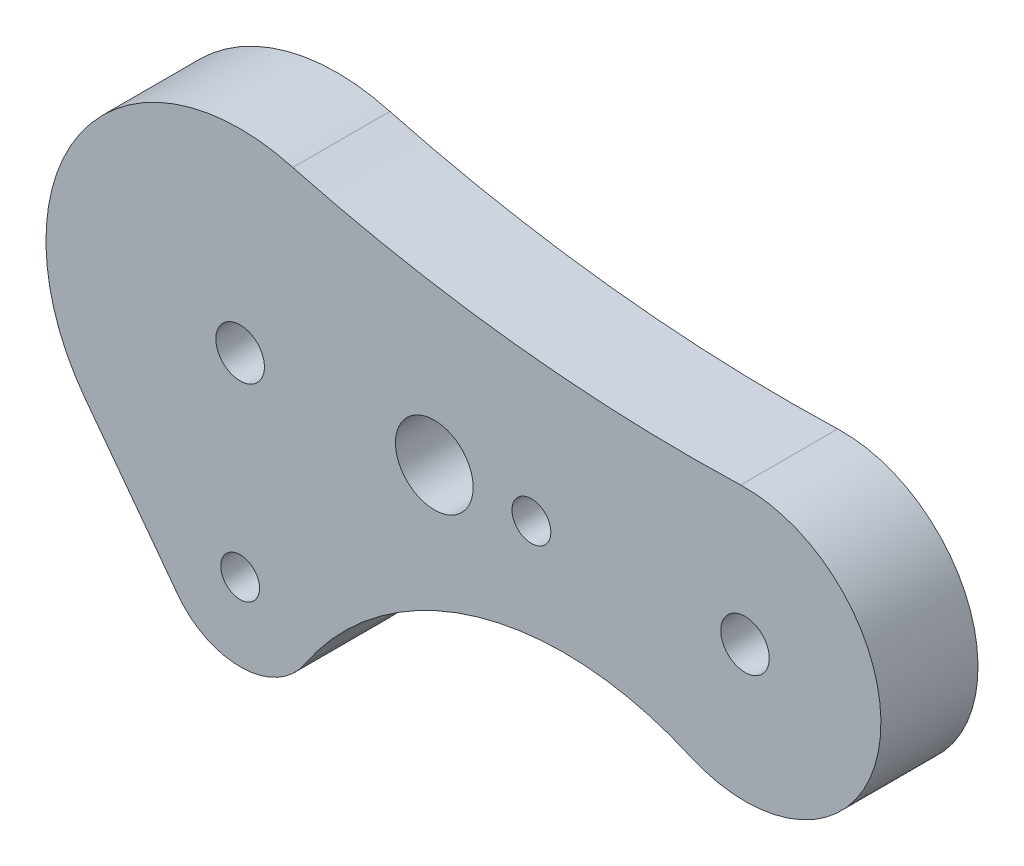
ISO-10303-21;
HEADER;
FILE_DESCRIPTION(('STEP AP214'),'2;1');
FILE_NAME('part.step','',(''),(''),'','','');
FILE_SCHEMA(('AUTOMOTIVE_DESIGN { 1 0 10303 214 1 1 1 1 }'));
ENDSEC;
DATA;
#1=APPLICATION_CONTEXT('core data for automotive mechanical design processes');
#2=APPLICATION_PROTOCOL_DEFINITION('international standard','automotive_design',2000,#1);
#3=PRODUCT_CONTEXT('',#1,'mechanical');
#4=PRODUCT('Part','Part','',(#3));
#5=PRODUCT_RELATED_PRODUCT_CATEGORY('part','',(#4));
#6=PRODUCT_DEFINITION_FORMATION('','',#4);
#7=PRODUCT_DEFINITION_CONTEXT('part definition',#1,'design');
#8=PRODUCT_DEFINITION('design','',#6,#7);
#9=PRODUCT_DEFINITION_SHAPE('','',#8);
#10=(LENGTH_UNIT() NAMED_UNIT(*) SI_UNIT(.MILLI.,.METRE.));
#11=(NAMED_UNIT(*) PLANE_ANGLE_UNIT() SI_UNIT($,.RADIAN.));
#12=(NAMED_UNIT(*) SI_UNIT($,.STERADIAN.) SOLID_ANGLE_UNIT());
#13=UNCERTAINTY_MEASURE_WITH_UNIT(LENGTH_MEASURE(1.E-05),#10,'distance_accuracy_value','');
#14=(GEOMETRIC_REPRESENTATION_CONTEXT(3) GLOBAL_UNCERTAINTY_ASSIGNED_CONTEXT((#13)) GLOBAL_UNIT_ASSIGNED_CONTEXT((#10,
#11,#12)) REPRESENTATION_CONTEXT('',''));
#15=CARTESIAN_POINT('',(0.,0.,0.));
#16=DIRECTION('',(0.,0.,1.));
#17=DIRECTION('',(1.,0.,0.));
#18=AXIS2_PLACEMENT_3D('',#15,#16,#17);
#19=CARTESIAN_POINT('',(0.,0.,5.));
#20=DIRECTION('',(0.,0.,1.));
#21=DIRECTION('',(1.,0.,0.));
#22=AXIS2_PLACEMENT_3D('',#19,#20,#21);
#23=PLANE('',#22);
#24=CARTESIAN_POINT('',(15.,0.,5.));
#25=DIRECTION('',(0.,0.,1.));
#26=DIRECTION('',(1.,0.,0.));
#27=AXIS2_PLACEMENT_3D('',#24,#25,#26);
#28=CIRCLE('',#27,1.);
#29=CARTESIAN_POINT('',(16.,0.,5.));
#30=VERTEX_POINT('',#29);
#31=EDGE_CURVE('E201',#30,#30,#28,.T.);
#32=ORIENTED_EDGE('',*,*,#31,.F.);
#33=EDGE_LOOP('',(#32));
#34=FACE_BOUND('',#33,.T.);
#35=CARTESIAN_POINT('',(26.,0.,5.));
#36=DIRECTION('',(0.,0.,1.));
#37=DIRECTION('',(1.,0.,0.));
#38=AXIS2_PLACEMENT_3D('',#35,#36,#37);
#39=CIRCLE('',#38,1.25);
#40=CARTESIAN_POINT('',(27.25,0.,5.));
#41=VERTEX_POINT('',#40);
#42=EDGE_CURVE('E213',#41,#41,#39,.T.);
#43=ORIENTED_EDGE('',*,*,#42,.F.);
#44=EDGE_LOOP('',(#43));
#45=FACE_BOUND('',#44,.T.);
#46=CARTESIAN_POINT('',(0.,0.,5.));
#47=DIRECTION('',(0.,0.,1.));
#48=DIRECTION('',(1.,0.,0.));
#49=AXIS2_PLACEMENT_3D('',#46,#47,#48);
#50=CIRCLE('',#49,10.);
#51=CARTESIAN_POINT('',(2.71288577864834,9.62498055852622,5.));
#52=VERTEX_POINT('',#51);
#53=CARTESIAN_POINT('',(-8.,-6.,5.));
#54=VERTEX_POINT('',#53);
#55=EDGE_CURVE('E137',#52,#54,#50,.T.);
#56=ORIENTED_EDGE('',*,*,#55,.T.);
#57=DIRECTION('',(0.6,-0.8,0.));
#58=VECTOR('',#57,1.);
#59=CARTESIAN_POINT('',(-8.,-6.,5.));
#60=LINE('',#59,#58);
#61=CARTESIAN_POINT('',(-3.2,-12.4,5.));
#62=VERTEX_POINT('',#61);
#63=EDGE_CURVE('E95',#54,#62,#60,.T.);
#64=ORIENTED_EDGE('',*,*,#63,.T.);
#65=CARTESIAN_POINT('',(0.,-10.,5.));
#66=DIRECTION('',(0.,0.,1.));
#67=DIRECTION('',(1.,0.,0.));
#68=AXIS2_PLACEMENT_3D('',#65,#66,#67);
#69=CIRCLE('',#68,4.);
#70=CARTESIAN_POINT('',(3.33684086860391,-12.2057862583702,5.));
#71=VERTEX_POINT('',#70);
#72=EDGE_CURVE('E108',#62,#71,#69,.T.);
#73=ORIENTED_EDGE('',*,*,#72,.T.);
#74=CARTESIAN_POINT('',(16.6842043430196,-21.0289312918509,5.));
#75=DIRECTION('',(0.,0.,-1.));
#76=DIRECTION('',(-1.,0.,0.));
#77=AXIS2_PLACEMENT_3D('',#74,#75,#76);
#78=CIRCLE('',#77,16.);
#79=CARTESIAN_POINT('',(23.1647578435277,-6.40010952360679,5.));
#80=VERTEX_POINT('',#79);
#81=EDGE_CURVE('E102',#71,#80,#78,.T.);
#82=ORIENTED_EDGE('',*,*,#81,.T.);
#83=CARTESIAN_POINT('',(26.,0.,5.));
#84=DIRECTION('',(0.,0.,1.));
#85=DIRECTION('',(1.,0.,0.));
#86=AXIS2_PLACEMENT_3D('',#83,#84,#85);
#87=CIRCLE('',#86,7.);
#88=CARTESIAN_POINT('',(25.7753375812971,6.99639384237499,5.));
#89=VERTEX_POINT('',#88);
#90=EDGE_CURVE('E106',#80,#89,#87,.T.);
#91=ORIENTED_EDGE('',*,*,#90,.T.);
#92=CARTESIAN_POINT('',(23.2077670818361,86.9551806123748,5.));
#93=DIRECTION('',(0.,0.,-1.));
#94=DIRECTION('',(1.,0.,0.));
#95=AXIS2_PLACEMENT_3D('',#92,#93,#94);
#96=CIRCLE('',#95,80.);
#97=EDGE_CURVE('E58',#89,#52,#96,.T.);
#98=ORIENTED_EDGE('',*,*,#97,.T.);
#99=EDGE_LOOP('',(#56,#64,#73,#82,#91,#98));
#100=FACE_BOUND('',#99,.T.);
#101=CARTESIAN_POINT('',(0.,0.,5.));
#102=DIRECTION('',(0.,0.,1.));
#103=DIRECTION('',(1.,0.,0.));
#104=AXIS2_PLACEMENT_3D('',#101,#102,#103);
#105=CIRCLE('',#104,1.25);
#106=CARTESIAN_POINT('',(1.25,0.,5.));
#107=VERTEX_POINT('',#106);
#108=EDGE_CURVE('E130',#107,#107,#105,.T.);
#109=ORIENTED_EDGE('',*,*,#108,.F.);
#110=EDGE_LOOP('',(#109));
#111=FACE_BOUND('',#110,.T.);
#112=CARTESIAN_POINT('',(10.,0.,5.));
#113=DIRECTION('',(0.,0.,1.));
#114=DIRECTION('',(1.,0.,0.));
#115=AXIS2_PLACEMENT_3D('',#112,#113,#114);
#116=CIRCLE('',#115,2.);
#117=CARTESIAN_POINT('',(12.,0.,5.));
#118=VERTEX_POINT('',#117);
#119=EDGE_CURVE('E207',#118,#118,#116,.T.);
#120=ORIENTED_EDGE('',*,*,#119,.F.);
#121=EDGE_LOOP('',(#120));
#122=FACE_BOUND('',#121,.T.);
#123=CARTESIAN_POINT('',(0.,-10.,5.));
#124=DIRECTION('',(0.,0.,1.));
#125=DIRECTION('',(1.,0.,0.));
#126=AXIS2_PLACEMENT_3D('',#123,#124,#125);
#127=CIRCLE('',#126,1.);
#128=CARTESIAN_POINT('',(1.,-10.,5.));
#129=VERTEX_POINT('',#128);
#130=EDGE_CURVE('E192',#129,#129,#127,.T.);
#131=ORIENTED_EDGE('',*,*,#130,.F.);
#132=EDGE_LOOP('',(#131));
#133=FACE_BOUND('',#132,.T.);
#134=ADVANCED_FACE('F41',(#34,#45,#100,#111,#122,#133),#23,.T.);
#135=CARTESIAN_POINT('',(0.,0.,0.));
#136=DIRECTION('',(0.,0.,1.));
#137=DIRECTION('',(1.,0.,0.));
#138=AXIS2_PLACEMENT_3D('',#135,#136,#137);
#139=PLANE('',#138);
#140=CARTESIAN_POINT('',(0.,0.,0.));
#141=DIRECTION('',(0.,0.,1.));
#142=DIRECTION('',(1.,0.,0.));
#143=AXIS2_PLACEMENT_3D('',#140,#141,#142);
#144=CIRCLE('',#143,10.);
#145=CARTESIAN_POINT('',(2.71288577864834,9.62498055852622,0.));
#146=VERTEX_POINT('',#145);
#147=CARTESIAN_POINT('',(-8.,-6.,0.));
#148=VERTEX_POINT('',#147);
#149=EDGE_CURVE('E126',#146,#148,#144,.T.);
#150=ORIENTED_EDGE('',*,*,#149,.F.);
#151=CARTESIAN_POINT('',(23.2077670818361,86.9551806123748,0.));
#152=DIRECTION('',(0.,0.,-1.));
#153=DIRECTION('',(1.,0.,0.));
#154=AXIS2_PLACEMENT_3D('',#151,#152,#153);
#155=CIRCLE('',#154,80.);
#156=CARTESIAN_POINT('',(25.7753375812971,6.99639384237499,0.));
#157=VERTEX_POINT('',#156);
#158=EDGE_CURVE('E87',#157,#146,#155,.T.);
#159=ORIENTED_EDGE('',*,*,#158,.F.);
#160=CARTESIAN_POINT('',(26.,0.,0.));
#161=DIRECTION('',(0.,0.,1.));
#162=DIRECTION('',(1.,0.,0.));
#163=AXIS2_PLACEMENT_3D('',#160,#161,#162);
#164=CIRCLE('',#163,7.);
#165=CARTESIAN_POINT('',(23.1647578435277,-6.40010952360679,0.));
#166=VERTEX_POINT('',#165);
#167=EDGE_CURVE('E81',#166,#157,#164,.T.);
#168=ORIENTED_EDGE('',*,*,#167,.F.);
#169=CARTESIAN_POINT('',(16.6842043430196,-21.0289312918509,0.));
#170=DIRECTION('',(0.,0.,-1.));
#171=DIRECTION('',(-1.,0.,0.));
#172=AXIS2_PLACEMENT_3D('',#169,#170,#171);
#173=CIRCLE('',#172,16.);
#174=CARTESIAN_POINT('',(3.33684086860391,-12.2057862583702,0.));
#175=VERTEX_POINT('',#174);
#176=EDGE_CURVE('E116',#175,#166,#173,.T.);
#177=ORIENTED_EDGE('',*,*,#176,.F.);
#178=CARTESIAN_POINT('',(0.,-10.,0.));
#179=DIRECTION('',(0.,0.,1.));
#180=DIRECTION('',(1.,0.,0.));
#181=AXIS2_PLACEMENT_3D('',#178,#179,#180);
#182=CIRCLE('',#181,4.);
#183=CARTESIAN_POINT('',(-3.2,-12.4,0.));
#184=VERTEX_POINT('',#183);
#185=EDGE_CURVE('E132',#184,#175,#182,.T.);
#186=ORIENTED_EDGE('',*,*,#185,.F.);
#187=DIRECTION('',(0.6,-0.8,0.));
#188=VECTOR('',#187,1.);
#189=CARTESIAN_POINT('',(-8.,-6.,0.));
#190=LINE('',#189,#188);
#191=EDGE_CURVE('E129',#148,#184,#190,.T.);
#192=ORIENTED_EDGE('',*,*,#191,.F.);
#193=EDGE_LOOP('',(#150,#159,#168,#177,#186,#192));
#194=FACE_BOUND('',#193,.T.);
#195=CARTESIAN_POINT('',(0.,0.,0.));
#196=DIRECTION('',(0.,0.,1.));
#197=DIRECTION('',(1.,0.,0.));
#198=AXIS2_PLACEMENT_3D('',#195,#196,#197);
#199=CIRCLE('',#198,1.25);
#200=CARTESIAN_POINT('',(1.25,0.,0.));
#201=VERTEX_POINT('',#200);
#202=EDGE_CURVE('E216',#201,#201,#199,.T.);
#203=ORIENTED_EDGE('',*,*,#202,.T.);
#204=EDGE_LOOP('',(#203));
#205=FACE_BOUND('',#204,.T.);
#206=CARTESIAN_POINT('',(26.,0.,0.));
#207=DIRECTION('',(0.,0.,1.));
#208=DIRECTION('',(1.,0.,0.));
#209=AXIS2_PLACEMENT_3D('',#206,#207,#208);
#210=CIRCLE('',#209,1.25);
#211=CARTESIAN_POINT('',(27.25,0.,0.));
#212=VERTEX_POINT('',#211);
#213=EDGE_CURVE('E210',#212,#212,#210,.T.);
#214=ORIENTED_EDGE('',*,*,#213,.T.);
#215=EDGE_LOOP('',(#214));
#216=FACE_BOUND('',#215,.T.);
#217=CARTESIAN_POINT('',(10.,0.,0.));
#218=DIRECTION('',(0.,0.,1.));
#219=DIRECTION('',(1.,0.,0.));
#220=AXIS2_PLACEMENT_3D('',#217,#218,#219);
#221=CIRCLE('',#220,2.);
#222=CARTESIAN_POINT('',(12.,0.,0.));
#223=VERTEX_POINT('',#222);
#224=EDGE_CURVE('E204',#223,#223,#221,.T.);
#225=ORIENTED_EDGE('',*,*,#224,.T.);
#226=EDGE_LOOP('',(#225));
#227=FACE_BOUND('',#226,.T.);
#228=CARTESIAN_POINT('',(15.,0.,0.));
#229=DIRECTION('',(0.,0.,1.));
#230=DIRECTION('',(1.,0.,0.));
#231=AXIS2_PLACEMENT_3D('',#228,#229,#230);
#232=CIRCLE('',#231,1.);
#233=CARTESIAN_POINT('',(16.,0.,0.));
#234=VERTEX_POINT('',#233);
#235=EDGE_CURVE('E198',#234,#234,#232,.T.);
#236=ORIENTED_EDGE('',*,*,#235,.T.);
#237=EDGE_LOOP('',(#236));
#238=FACE_BOUND('',#237,.T.);
#239=CARTESIAN_POINT('',(0.,-10.,0.));
#240=DIRECTION('',(0.,0.,1.));
#241=DIRECTION('',(1.,0.,0.));
#242=AXIS2_PLACEMENT_3D('',#239,#240,#241);
#243=CIRCLE('',#242,1.);
#244=CARTESIAN_POINT('',(1.,-10.,0.));
#245=VERTEX_POINT('',#244);
#246=EDGE_CURVE('E195',#245,#245,#243,.T.);
#247=ORIENTED_EDGE('',*,*,#246,.T.);
#248=EDGE_LOOP('',(#247));
#249=FACE_BOUND('',#248,.T.);
#250=ADVANCED_FACE('F146',(#194,#205,#216,#227,#238,#249),#139,.F.);
#251=CARTESIAN_POINT('',(0.,0.,5.));
#252=DIRECTION('',(0.,0.,-1.));
#253=DIRECTION('',(-1.,0.,0.));
#254=AXIS2_PLACEMENT_3D('',#251,#252,#253);
#255=CYLINDRICAL_SURFACE('',#254,10.);
#256=ORIENTED_EDGE('',*,*,#149,.T.);
#257=DIRECTION('',(0.,0.,-1.));
#258=VECTOR('',#257,1.);
#259=CARTESIAN_POINT('',(-8.,-6.,5.));
#260=LINE('',#259,#258);
#261=EDGE_CURVE('E11',#54,#148,#260,.T.);
#262=ORIENTED_EDGE('',*,*,#261,.F.);
#263=ORIENTED_EDGE('',*,*,#55,.F.);
#264=DIRECTION('',(0.,0.,-1.));
#265=VECTOR('',#264,1.);
#266=CARTESIAN_POINT('',(2.71288577864834,9.62498055852622,5.));
#267=LINE('',#266,#265);
#268=EDGE_CURVE('E122',#52,#146,#267,.T.);
#269=ORIENTED_EDGE('',*,*,#268,.T.);
#270=EDGE_LOOP('',(#256,#262,#263,#269));
#271=FACE_BOUND('',#270,.T.);
#272=ADVANCED_FACE('F43',(#271),#255,.T.);
#273=CARTESIAN_POINT('',(-8.,-6.,5.));
#274=DIRECTION('',(0.8,0.6,0.));
#275=DIRECTION('',(-0.6,0.8,0.));
#276=AXIS2_PLACEMENT_3D('',#273,#274,#275);
#277=PLANE('',#276);
#278=ORIENTED_EDGE('',*,*,#191,.T.);
#279=DIRECTION('',(0.,0.,-1.));
#280=VECTOR('',#279,1.);
#281=CARTESIAN_POINT('',(-3.2,-12.4,5.));
#282=LINE('',#281,#280);
#283=EDGE_CURVE('E50',#62,#184,#282,.T.);
#284=ORIENTED_EDGE('',*,*,#283,.F.);
#285=ORIENTED_EDGE('',*,*,#63,.F.);
#286=ORIENTED_EDGE('',*,*,#261,.T.);
#287=EDGE_LOOP('',(#278,#284,#285,#286));
#288=FACE_BOUND('',#287,.T.);
#289=ADVANCED_FACE('F318',(#288),#277,.F.);
#290=CARTESIAN_POINT('',(0.,-10.,5.));
#291=DIRECTION('',(0.,0.,-1.));
#292=DIRECTION('',(-1.,0.,0.));
#293=AXIS2_PLACEMENT_3D('',#290,#291,#292);
#294=CYLINDRICAL_SURFACE('',#293,4.);
#295=ORIENTED_EDGE('',*,*,#185,.T.);
#296=DIRECTION('',(0.,0.,-1.));
#297=VECTOR('',#296,1.);
#298=CARTESIAN_POINT('',(3.33684086860391,-12.2057862583702,5.));
#299=LINE('',#298,#297);
#300=EDGE_CURVE('E117',#71,#175,#299,.T.);
#301=ORIENTED_EDGE('',*,*,#300,.F.);
#302=ORIENTED_EDGE('',*,*,#72,.F.);
#303=ORIENTED_EDGE('',*,*,#283,.T.);
#304=EDGE_LOOP('',(#295,#301,#302,#303));
#305=FACE_BOUND('',#304,.T.);
#306=ADVANCED_FACE('F143',(#305),#294,.T.);
#307=CARTESIAN_POINT('',(16.6842043430196,-21.0289312918509,5.));
#308=DIRECTION('',(0.,0.,-1.));
#309=DIRECTION('',(-1.,0.,0.));
#310=AXIS2_PLACEMENT_3D('',#307,#308,#309);
#311=CYLINDRICAL_SURFACE('',#310,16.);
#312=ORIENTED_EDGE('',*,*,#176,.T.);
#313=DIRECTION('',(0.,0.,-1.));
#314=VECTOR('',#313,1.);
#315=CARTESIAN_POINT('',(23.1647578435277,-6.40010952360679,5.));
#316=LINE('',#315,#314);
#317=EDGE_CURVE('E113',#80,#166,#316,.T.);
#318=ORIENTED_EDGE('',*,*,#317,.F.);
#319=ORIENTED_EDGE('',*,*,#81,.F.);
#320=ORIENTED_EDGE('',*,*,#300,.T.);
#321=EDGE_LOOP('',(#312,#318,#319,#320));
#322=FACE_BOUND('',#321,.T.);
#323=ADVANCED_FACE('F114',(#322),#311,.F.);
#324=CARTESIAN_POINT('',(26.,0.,5.));
#325=DIRECTION('',(0.,0.,-1.));
#326=DIRECTION('',(-1.,0.,0.));
#327=AXIS2_PLACEMENT_3D('',#324,#325,#326);
#328=CYLINDRICAL_SURFACE('',#327,7.);
#329=ORIENTED_EDGE('',*,*,#167,.T.);
#330=DIRECTION('',(0.,0.,-1.));
#331=VECTOR('',#330,1.);
#332=CARTESIAN_POINT('',(25.7753375812971,6.99639384237499,5.));
#333=LINE('',#332,#331);
#334=EDGE_CURVE('E118',#89,#157,#333,.T.);
#335=ORIENTED_EDGE('',*,*,#334,.F.);
#336=ORIENTED_EDGE('',*,*,#90,.F.);
#337=ORIENTED_EDGE('',*,*,#317,.T.);
#338=EDGE_LOOP('',(#329,#335,#336,#337));
#339=FACE_BOUND('',#338,.T.);
#340=ADVANCED_FACE('F120',(#339),#328,.T.);
#341=CARTESIAN_POINT('',(23.2077670818361,86.9551806123748,5.));
#342=DIRECTION('',(0.,0.,-1.));
#343=DIRECTION('',(-1.,0.,0.));
#344=AXIS2_PLACEMENT_3D('',#341,#342,#343);
#345=CYLINDRICAL_SURFACE('',#344,80.);
#346=ORIENTED_EDGE('',*,*,#158,.T.);
#347=ORIENTED_EDGE('',*,*,#268,.F.);
#348=ORIENTED_EDGE('',*,*,#97,.F.);
#349=ORIENTED_EDGE('',*,*,#334,.T.);
#350=EDGE_LOOP('',(#346,#347,#348,#349));
#351=FACE_BOUND('',#350,.T.);
#352=ADVANCED_FACE('F151',(#351),#345,.F.);
#353=CARTESIAN_POINT('',(0.,0.,5.));
#354=DIRECTION('',(0.,0.,-1.));
#355=DIRECTION('',(-1.,0.,0.));
#356=AXIS2_PLACEMENT_3D('',#353,#354,#355);
#357=CYLINDRICAL_SURFACE('',#356,1.25);
#358=ORIENTED_EDGE('',*,*,#108,.T.);
#359=EDGE_LOOP('',(#358));
#360=FACE_BOUND('',#359,.T.);
#361=ORIENTED_EDGE('',*,*,#202,.F.);
#362=EDGE_LOOP('',(#361));
#363=FACE_BOUND('',#362,.T.);
#364=ADVANCED_FACE('F153',(#360,#363),#357,.F.);
#365=CARTESIAN_POINT('',(26.,0.,5.));
#366=DIRECTION('',(0.,0.,-1.));
#367=DIRECTION('',(-1.,0.,0.));
#368=AXIS2_PLACEMENT_3D('',#365,#366,#367);
#369=CYLINDRICAL_SURFACE('',#368,1.25);
#370=ORIENTED_EDGE('',*,*,#42,.T.);
#371=EDGE_LOOP('',(#370));
#372=FACE_BOUND('',#371,.T.);
#373=ORIENTED_EDGE('',*,*,#213,.F.);
#374=EDGE_LOOP('',(#373));
#375=FACE_BOUND('',#374,.T.);
#376=ADVANCED_FACE('F159',(#372,#375),#369,.F.);
#377=CARTESIAN_POINT('',(10.,0.,5.));
#378=DIRECTION('',(0.,0.,-1.));
#379=DIRECTION('',(-1.,0.,0.));
#380=AXIS2_PLACEMENT_3D('',#377,#378,#379);
#381=CYLINDRICAL_SURFACE('',#380,2.);
#382=ORIENTED_EDGE('',*,*,#119,.T.);
#383=EDGE_LOOP('',(#382));
#384=FACE_BOUND('',#383,.T.);
#385=ORIENTED_EDGE('',*,*,#224,.F.);
#386=EDGE_LOOP('',(#385));
#387=FACE_BOUND('',#386,.T.);
#388=ADVANCED_FACE('F175',(#384,#387),#381,.F.);
#389=CARTESIAN_POINT('',(15.,0.,5.));
#390=DIRECTION('',(0.,0.,-1.));
#391=DIRECTION('',(-1.,0.,0.));
#392=AXIS2_PLACEMENT_3D('',#389,#390,#391);
#393=CYLINDRICAL_SURFACE('',#392,1.);
#394=ORIENTED_EDGE('',*,*,#31,.T.);
#395=EDGE_LOOP('',(#394));
#396=FACE_BOUND('',#395,.T.);
#397=ORIENTED_EDGE('',*,*,#235,.F.);
#398=EDGE_LOOP('',(#397));
#399=FACE_BOUND('',#398,.T.);
#400=ADVANCED_FACE('F179',(#396,#399),#393,.F.);
#401=CARTESIAN_POINT('',(0.,-10.,5.));
#402=DIRECTION('',(0.,0.,-1.));
#403=DIRECTION('',(-1.,0.,0.));
#404=AXIS2_PLACEMENT_3D('',#401,#402,#403);
#405=CYLINDRICAL_SURFACE('',#404,1.);
#406=ORIENTED_EDGE('',*,*,#130,.T.);
#407=EDGE_LOOP('',(#406));
#408=FACE_BOUND('',#407,.T.);
#409=ORIENTED_EDGE('',*,*,#246,.F.);
#410=EDGE_LOOP('',(#409));
#411=FACE_BOUND('',#410,.T.);
#412=ADVANCED_FACE('F183',(#408,#411),#405,.F.);
#413=CLOSED_SHELL('',(#134,#250,#272,#289,#306,#323,#340,#352,#364,#376,#388,#400,#412));
#414=MANIFOLD_SOLID_BREP('B2',#413);
#415=ADVANCED_BREP_SHAPE_REPRESENTATION('',(#18,#414),#14);
#416=SHAPE_DEFINITION_REPRESENTATION(#9,#415);
ENDSEC;
END-ISO-10303-21;
